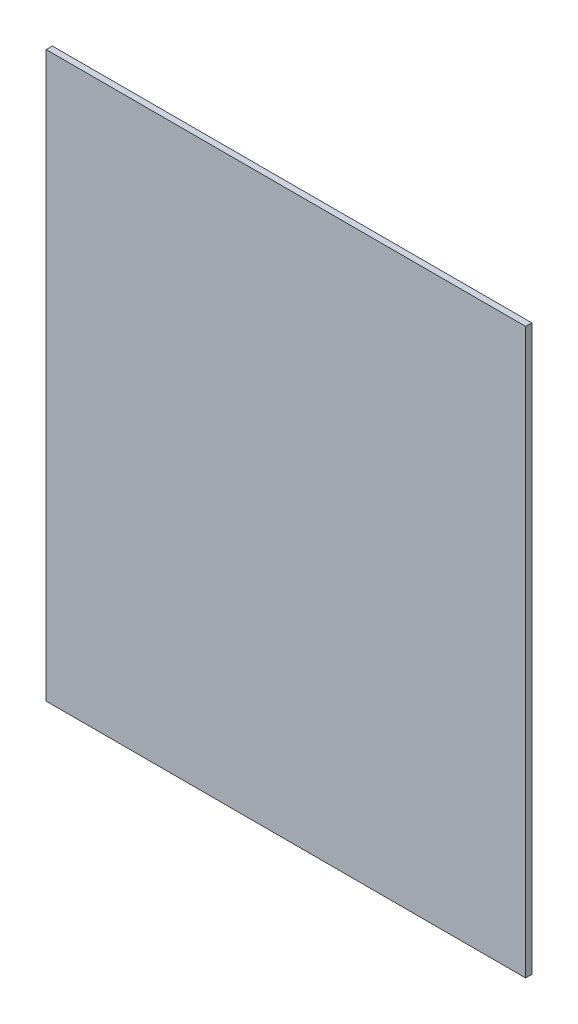
ISO-10303-21;
HEADER;
FILE_DESCRIPTION(('STEP AP214'),'2;1');
FILE_NAME('part.step','',(''),(''),'','','');
FILE_SCHEMA(('AUTOMOTIVE_DESIGN { 1 0 10303 214 1 1 1 1 }'));
ENDSEC;
DATA;
#1=APPLICATION_CONTEXT('core data for automotive mechanical design processes');
#2=APPLICATION_PROTOCOL_DEFINITION('international standard','automotive_design',2000,#1);
#3=PRODUCT_CONTEXT('',#1,'mechanical');
#4=PRODUCT('Part','Part','',(#3));
#5=PRODUCT_RELATED_PRODUCT_CATEGORY('part','',(#4));
#6=PRODUCT_DEFINITION_FORMATION('','',#4);
#7=PRODUCT_DEFINITION_CONTEXT('part definition',#1,'design');
#8=PRODUCT_DEFINITION('design','',#6,#7);
#9=PRODUCT_DEFINITION_SHAPE('','',#8);
#10=(LENGTH_UNIT() NAMED_UNIT(*) SI_UNIT(.MILLI.,.METRE.));
#11=(NAMED_UNIT(*) PLANE_ANGLE_UNIT() SI_UNIT($,.RADIAN.));
#12=(NAMED_UNIT(*) SI_UNIT($,.STERADIAN.) SOLID_ANGLE_UNIT());
#13=UNCERTAINTY_MEASURE_WITH_UNIT(LENGTH_MEASURE(1.E-05),#10,'distance_accuracy_value','');
#14=(GEOMETRIC_REPRESENTATION_CONTEXT(3) GLOBAL_UNCERTAINTY_ASSIGNED_CONTEXT((#13)) GLOBAL_UNIT_ASSIGNED_CONTEXT((#10,
#11,#12)) REPRESENTATION_CONTEXT('',''));
#15=CARTESIAN_POINT('',(0.,0.,0.));
#16=DIRECTION('',(0.,0.,1.));
#17=DIRECTION('',(1.,0.,0.));
#18=AXIS2_PLACEMENT_3D('',#15,#16,#17);
#19=CARTESIAN_POINT('',(0.,0.,1.));
#20=DIRECTION('',(1.,0.,0.));
#21=DIRECTION('',(0.,0.,-1.));
#22=AXIS2_PLACEMENT_3D('',#19,#20,#21);
#23=PLANE('',#22);
#24=DIRECTION('',(0.,-1.,0.));
#25=VECTOR('',#24,1.);
#26=CARTESIAN_POINT('',(0.,0.,0.));
#27=LINE('',#26,#25);
#28=CARTESIAN_POINT('',(0.,91.2,0.));
#29=VERTEX_POINT('',#28);
#30=CARTESIAN_POINT('',(0.,0.,0.));
#31=VERTEX_POINT('',#30);
#32=EDGE_CURVE('E95',#29,#31,#27,.T.);
#33=ORIENTED_EDGE('',*,*,#32,.T.);
#34=DIRECTION('',(0.,0.,-1.));
#35=VECTOR('',#34,1.);
#36=CARTESIAN_POINT('',(0.,0.,1.));
#37=LINE('',#36,#35);
#38=CARTESIAN_POINT('',(0.,0.,1.));
#39=VERTEX_POINT('',#38);
#40=EDGE_CURVE('E11',#39,#31,#37,.T.);
#41=ORIENTED_EDGE('',*,*,#40,.F.);
#42=DIRECTION('',(0.,-1.,0.));
#43=VECTOR('',#42,1.);
#44=CARTESIAN_POINT('',(0.,0.,1.));
#45=LINE('',#44,#43);
#46=CARTESIAN_POINT('',(0.,91.2,1.));
#47=VERTEX_POINT('',#46);
#48=EDGE_CURVE('E83',#47,#39,#45,.T.);
#49=ORIENTED_EDGE('',*,*,#48,.F.);
#50=DIRECTION('',(0.,0.,-1.));
#51=VECTOR('',#50,1.);
#52=CARTESIAN_POINT('',(0.,91.2,1.));
#53=LINE('',#52,#51);
#54=EDGE_CURVE('E91',#47,#29,#53,.T.);
#55=ORIENTED_EDGE('',*,*,#54,.T.);
#56=EDGE_LOOP('',(#33,#41,#49,#55));
#57=FACE_BOUND('',#56,.T.);
#58=ADVANCED_FACE('F32',(#57),#23,.F.);
#59=CARTESIAN_POINT('',(0.,0.,1.));
#60=DIRECTION('',(0.,1.,0.));
#61=DIRECTION('',(0.,0.,1.));
#62=AXIS2_PLACEMENT_3D('',#59,#60,#61);
#63=PLANE('',#62);
#64=DIRECTION('',(1.,0.,0.));
#65=VECTOR('',#64,1.);
#66=CARTESIAN_POINT('',(0.,0.,0.));
#67=LINE('',#66,#65);
#68=CARTESIAN_POINT('',(77.5,0.,0.));
#69=VERTEX_POINT('',#68);
#70=EDGE_CURVE('E87',#31,#69,#67,.T.);
#71=ORIENTED_EDGE('',*,*,#70,.T.);
#72=DIRECTION('',(0.,0.,-1.));
#73=VECTOR('',#72,1.);
#74=CARTESIAN_POINT('',(77.5,0.,1.));
#75=LINE('',#74,#73);
#76=CARTESIAN_POINT('',(77.5,0.,1.));
#77=VERTEX_POINT('',#76);
#78=EDGE_CURVE('E40',#77,#69,#75,.T.);
#79=ORIENTED_EDGE('',*,*,#78,.F.);
#80=DIRECTION('',(1.,0.,0.));
#81=VECTOR('',#80,1.);
#82=CARTESIAN_POINT('',(0.,0.,1.));
#83=LINE('',#82,#81);
#84=EDGE_CURVE('E78',#39,#77,#83,.T.);
#85=ORIENTED_EDGE('',*,*,#84,.F.);
#86=ORIENTED_EDGE('',*,*,#40,.T.);
#87=EDGE_LOOP('',(#71,#79,#85,#86));
#88=FACE_BOUND('',#87,.T.);
#89=ADVANCED_FACE('F86',(#88),#63,.F.);
#90=CARTESIAN_POINT('',(77.5,0.,1.));
#91=DIRECTION('',(-1.,0.,0.));
#92=DIRECTION('',(0.,0.,1.));
#93=AXIS2_PLACEMENT_3D('',#90,#91,#92);
#94=PLANE('',#93);
#95=DIRECTION('',(0.,1.,0.));
#96=VECTOR('',#95,1.);
#97=CARTESIAN_POINT('',(77.5,0.,0.));
#98=LINE('',#97,#96);
#99=CARTESIAN_POINT('',(77.5,91.2,0.));
#100=VERTEX_POINT('',#99);
#101=EDGE_CURVE('E65',#69,#100,#98,.T.);
#102=ORIENTED_EDGE('',*,*,#101,.T.);
#103=DIRECTION('',(0.,0.,-1.));
#104=VECTOR('',#103,1.);
#105=CARTESIAN_POINT('',(77.5,91.2,1.));
#106=LINE('',#105,#104);
#107=CARTESIAN_POINT('',(77.5,91.2,1.));
#108=VERTEX_POINT('',#107);
#109=EDGE_CURVE('E88',#108,#100,#106,.T.);
#110=ORIENTED_EDGE('',*,*,#109,.F.);
#111=DIRECTION('',(0.,1.,0.));
#112=VECTOR('',#111,1.);
#113=CARTESIAN_POINT('',(77.5,0.,1.));
#114=LINE('',#113,#112);
#115=EDGE_CURVE('E81',#77,#108,#114,.T.);
#116=ORIENTED_EDGE('',*,*,#115,.F.);
#117=ORIENTED_EDGE('',*,*,#78,.T.);
#118=EDGE_LOOP('',(#102,#110,#116,#117));
#119=FACE_BOUND('',#118,.T.);
#120=ADVANCED_FACE('F89',(#119),#94,.F.);
#121=CARTESIAN_POINT('',(0.,91.2,1.));
#122=DIRECTION('',(0.,-1.,0.));
#123=DIRECTION('',(0.,0.,-1.));
#124=AXIS2_PLACEMENT_3D('',#121,#122,#123);
#125=PLANE('',#124);
#126=DIRECTION('',(-1.,0.,0.));
#127=VECTOR('',#126,1.);
#128=CARTESIAN_POINT('',(0.,91.2,0.));
#129=LINE('',#128,#127);
#130=EDGE_CURVE('E71',#100,#29,#129,.T.);
#131=ORIENTED_EDGE('',*,*,#130,.T.);
#132=ORIENTED_EDGE('',*,*,#54,.F.);
#133=DIRECTION('',(-1.,0.,0.));
#134=VECTOR('',#133,1.);
#135=CARTESIAN_POINT('',(0.,91.2,1.));
#136=LINE('',#135,#134);
#137=EDGE_CURVE('E48',#108,#47,#136,.T.);
#138=ORIENTED_EDGE('',*,*,#137,.F.);
#139=ORIENTED_EDGE('',*,*,#109,.T.);
#140=EDGE_LOOP('',(#131,#132,#138,#139));
#141=FACE_BOUND('',#140,.T.);
#142=ADVANCED_FACE('F102',(#141),#125,.F.);
#143=CARTESIAN_POINT('',(0.,0.,1.));
#144=DIRECTION('',(0.,0.,-1.));
#145=DIRECTION('',(-1.,0.,0.));
#146=AXIS2_PLACEMENT_3D('',#143,#144,#145);
#147=PLANE('',#146);
#148=ORIENTED_EDGE('',*,*,#48,.T.);
#149=ORIENTED_EDGE('',*,*,#84,.T.);
#150=ORIENTED_EDGE('',*,*,#115,.T.);
#151=ORIENTED_EDGE('',*,*,#137,.T.);
#152=EDGE_LOOP('',(#148,#149,#150,#151));
#153=FACE_BOUND('',#152,.T.);
#154=ADVANCED_FACE('F79',(#153),#147,.F.);
#155=CARTESIAN_POINT('',(0.,0.,0.));
#156=DIRECTION('',(0.,0.,-1.));
#157=DIRECTION('',(-1.,0.,0.));
#158=AXIS2_PLACEMENT_3D('',#155,#156,#157);
#159=PLANE('',#158);
#160=ORIENTED_EDGE('',*,*,#32,.F.);
#161=ORIENTED_EDGE('',*,*,#130,.F.);
#162=ORIENTED_EDGE('',*,*,#101,.F.);
#163=ORIENTED_EDGE('',*,*,#70,.F.);
#164=EDGE_LOOP('',(#160,#161,#162,#163));
#165=FACE_BOUND('',#164,.T.);
#166=ADVANCED_FACE('F105',(#165),#159,.T.);
#167=CLOSED_SHELL('',(#58,#89,#120,#142,#154,#166));
#168=MANIFOLD_SOLID_BREP('B2',#167);
#169=ADVANCED_BREP_SHAPE_REPRESENTATION('',(#18,#168),#14);
#170=SHAPE_DEFINITION_REPRESENTATION(#9,#169);
ENDSEC;
END-ISO-10303-21;
